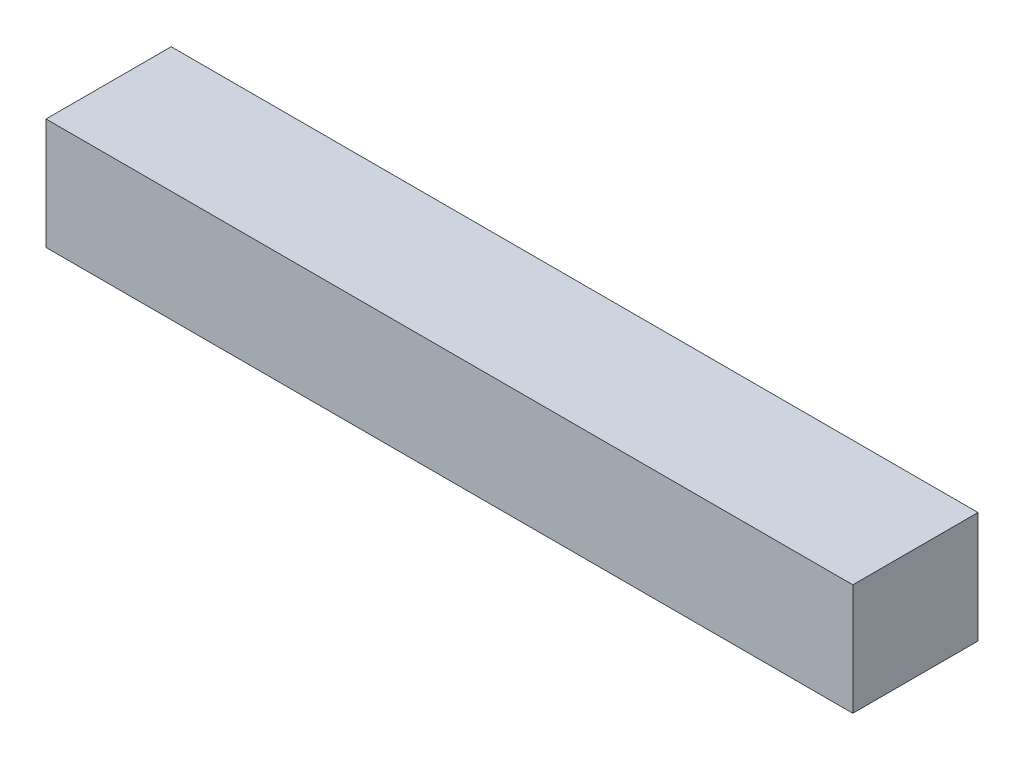
ISO-10303-21;
HEADER;
FILE_DESCRIPTION(('STEP AP214'),'2;1');
FILE_NAME('part.step','',(''),(''),'','','');
FILE_SCHEMA(('AUTOMOTIVE_DESIGN { 1 0 10303 214 1 1 1 1 }'));
ENDSEC;
DATA;
#1=APPLICATION_CONTEXT('core data for automotive mechanical design processes');
#2=APPLICATION_PROTOCOL_DEFINITION('international standard','automotive_design',2000,#1);
#3=PRODUCT_CONTEXT('',#1,'mechanical');
#4=PRODUCT('Part','Part','',(#3));
#5=PRODUCT_RELATED_PRODUCT_CATEGORY('part','',(#4));
#6=PRODUCT_DEFINITION_FORMATION('','',#4);
#7=PRODUCT_DEFINITION_CONTEXT('part definition',#1,'design');
#8=PRODUCT_DEFINITION('design','',#6,#7);
#9=PRODUCT_DEFINITION_SHAPE('','',#8);
#10=(LENGTH_UNIT() NAMED_UNIT(*) SI_UNIT(.MILLI.,.METRE.));
#11=(NAMED_UNIT(*) PLANE_ANGLE_UNIT() SI_UNIT($,.RADIAN.));
#12=(NAMED_UNIT(*) SI_UNIT($,.STERADIAN.) SOLID_ANGLE_UNIT());
#13=UNCERTAINTY_MEASURE_WITH_UNIT(LENGTH_MEASURE(1.E-05),#10,'distance_accuracy_value','');
#14=(GEOMETRIC_REPRESENTATION_CONTEXT(3) GLOBAL_UNCERTAINTY_ASSIGNED_CONTEXT((#13)) GLOBAL_UNIT_ASSIGNED_CONTEXT((#10,
#11,#12)) REPRESENTATION_CONTEXT('',''));
#15=CARTESIAN_POINT('',(0.,0.,0.));
#16=DIRECTION('',(0.,0.,1.));
#17=DIRECTION('',(1.,0.,0.));
#18=AXIS2_PLACEMENT_3D('',#15,#16,#17);
#19=CARTESIAN_POINT('',(29.,8.,-4.49999999999999));
#20=DIRECTION('',(-1.,0.,0.));
#21=DIRECTION('',(0.,0.,1.));
#22=AXIS2_PLACEMENT_3D('',#19,#20,#21);
#23=PLANE('',#22);
#24=DIRECTION('',(0.,0.,-1.));
#25=VECTOR('',#24,1.);
#26=CARTESIAN_POINT('',(29.,0.,-4.49999999999999));
#27=LINE('',#26,#25);
#28=CARTESIAN_POINT('',(29.,0.,4.50000000000002));
#29=VERTEX_POINT('',#28);
#30=CARTESIAN_POINT('',(29.,0.,-4.49999999999999));
#31=VERTEX_POINT('',#30);
#32=EDGE_CURVE('E97',#29,#31,#27,.T.);
#33=ORIENTED_EDGE('',*,*,#32,.T.);
#34=DIRECTION('',(0.,-1.,0.));
#35=VECTOR('',#34,1.);
#36=CARTESIAN_POINT('',(29.,8.,-4.49999999999999));
#37=LINE('',#36,#35);
#38=CARTESIAN_POINT('',(29.,8.,-4.49999999999999));
#39=VERTEX_POINT('',#38);
#40=EDGE_CURVE('E11',#39,#31,#37,.T.);
#41=ORIENTED_EDGE('',*,*,#40,.F.);
#42=DIRECTION('',(0.,0.,-1.));
#43=VECTOR('',#42,1.);
#44=CARTESIAN_POINT('',(29.,8.,-4.49999999999999));
#45=LINE('',#44,#43);
#46=CARTESIAN_POINT('',(29.,8.,4.50000000000002));
#47=VERTEX_POINT('',#46);
#48=EDGE_CURVE('E85',#47,#39,#45,.T.);
#49=ORIENTED_EDGE('',*,*,#48,.F.);
#50=DIRECTION('',(0.,-1.,0.));
#51=VECTOR('',#50,1.);
#52=CARTESIAN_POINT('',(29.,8.,4.50000000000002));
#53=LINE('',#52,#51);
#54=EDGE_CURVE('E93',#47,#29,#53,.T.);
#55=ORIENTED_EDGE('',*,*,#54,.T.);
#56=EDGE_LOOP('',(#33,#41,#49,#55));
#57=FACE_BOUND('',#56,.T.);
#58=ADVANCED_FACE('F34',(#57),#23,.F.);
#59=CARTESIAN_POINT('',(-29.,8.,-4.49999999999999));
#60=DIRECTION('',(0.,0.,1.));
#61=DIRECTION('',(1.,0.,0.));
#62=AXIS2_PLACEMENT_3D('',#59,#60,#61);
#63=PLANE('',#62);
#64=DIRECTION('',(-1.,0.,0.));
#65=VECTOR('',#64,1.);
#66=CARTESIAN_POINT('',(-29.,0.,-4.49999999999999));
#67=LINE('',#66,#65);
#68=CARTESIAN_POINT('',(-29.,0.,-4.49999999999999));
#69=VERTEX_POINT('',#68);
#70=EDGE_CURVE('E89',#31,#69,#67,.T.);
#71=ORIENTED_EDGE('',*,*,#70,.T.);
#72=DIRECTION('',(0.,-1.,0.));
#73=VECTOR('',#72,1.);
#74=CARTESIAN_POINT('',(-29.,8.,-4.49999999999999));
#75=LINE('',#74,#73);
#76=CARTESIAN_POINT('',(-29.,8.,-4.49999999999999));
#77=VERTEX_POINT('',#76);
#78=EDGE_CURVE('E42',#77,#69,#75,.T.);
#79=ORIENTED_EDGE('',*,*,#78,.F.);
#80=DIRECTION('',(-1.,0.,0.));
#81=VECTOR('',#80,1.);
#82=CARTESIAN_POINT('',(-29.,8.,-4.49999999999999));
#83=LINE('',#82,#81);
#84=EDGE_CURVE('E80',#39,#77,#83,.T.);
#85=ORIENTED_EDGE('',*,*,#84,.F.);
#86=ORIENTED_EDGE('',*,*,#40,.T.);
#87=EDGE_LOOP('',(#71,#79,#85,#86));
#88=FACE_BOUND('',#87,.T.);
#89=ADVANCED_FACE('F88',(#88),#63,.F.);
#90=CARTESIAN_POINT('',(-29.,8.,-4.49999999999999));
#91=DIRECTION('',(1.,0.,0.));
#92=DIRECTION('',(0.,0.,-1.));
#93=AXIS2_PLACEMENT_3D('',#90,#91,#92);
#94=PLANE('',#93);
#95=DIRECTION('',(0.,0.,1.));
#96=VECTOR('',#95,1.);
#97=CARTESIAN_POINT('',(-29.,0.,-4.49999999999999));
#98=LINE('',#97,#96);
#99=CARTESIAN_POINT('',(-29.,0.,4.50000000000002));
#100=VERTEX_POINT('',#99);
#101=EDGE_CURVE('E67',#69,#100,#98,.T.);
#102=ORIENTED_EDGE('',*,*,#101,.T.);
#103=DIRECTION('',(0.,-1.,0.));
#104=VECTOR('',#103,1.);
#105=CARTESIAN_POINT('',(-29.,8.,4.50000000000002));
#106=LINE('',#105,#104);
#107=CARTESIAN_POINT('',(-29.,8.,4.50000000000002));
#108=VERTEX_POINT('',#107);
#109=EDGE_CURVE('E90',#108,#100,#106,.T.);
#110=ORIENTED_EDGE('',*,*,#109,.F.);
#111=DIRECTION('',(0.,0.,1.));
#112=VECTOR('',#111,1.);
#113=CARTESIAN_POINT('',(-29.,8.,-4.49999999999999));
#114=LINE('',#113,#112);
#115=EDGE_CURVE('E83',#77,#108,#114,.T.);
#116=ORIENTED_EDGE('',*,*,#115,.F.);
#117=ORIENTED_EDGE('',*,*,#78,.T.);
#118=EDGE_LOOP('',(#102,#110,#116,#117));
#119=FACE_BOUND('',#118,.T.);
#120=ADVANCED_FACE('F91',(#119),#94,.F.);
#121=CARTESIAN_POINT('',(-29.,8.,4.50000000000002));
#122=DIRECTION('',(0.,0.,-1.));
#123=DIRECTION('',(-1.,0.,0.));
#124=AXIS2_PLACEMENT_3D('',#121,#122,#123);
#125=PLANE('',#124);
#126=DIRECTION('',(1.,0.,0.));
#127=VECTOR('',#126,1.);
#128=CARTESIAN_POINT('',(-29.,0.,4.50000000000002));
#129=LINE('',#128,#127);
#130=EDGE_CURVE('E73',#100,#29,#129,.T.);
#131=ORIENTED_EDGE('',*,*,#130,.T.);
#132=ORIENTED_EDGE('',*,*,#54,.F.);
#133=DIRECTION('',(1.,0.,0.));
#134=VECTOR('',#133,1.);
#135=CARTESIAN_POINT('',(-29.,8.,4.50000000000002));
#136=LINE('',#135,#134);
#137=EDGE_CURVE('E50',#108,#47,#136,.T.);
#138=ORIENTED_EDGE('',*,*,#137,.F.);
#139=ORIENTED_EDGE('',*,*,#109,.T.);
#140=EDGE_LOOP('',(#131,#132,#138,#139));
#141=FACE_BOUND('',#140,.T.);
#142=ADVANCED_FACE('F104',(#141),#125,.F.);
#143=CARTESIAN_POINT('',(0.,8.,0.));
#144=DIRECTION('',(0.,1.,0.));
#145=DIRECTION('',(0.,0.,1.));
#146=AXIS2_PLACEMENT_3D('',#143,#144,#145);
#147=PLANE('',#146);
#148=ORIENTED_EDGE('',*,*,#48,.T.);
#149=ORIENTED_EDGE('',*,*,#84,.T.);
#150=ORIENTED_EDGE('',*,*,#115,.T.);
#151=ORIENTED_EDGE('',*,*,#137,.T.);
#152=EDGE_LOOP('',(#148,#149,#150,#151));
#153=FACE_BOUND('',#152,.T.);
#154=ADVANCED_FACE('F81',(#153),#147,.T.);
#155=CARTESIAN_POINT('',(0.,0.,0.));
#156=DIRECTION('',(0.,1.,0.));
#157=DIRECTION('',(0.,0.,1.));
#158=AXIS2_PLACEMENT_3D('',#155,#156,#157);
#159=PLANE('',#158);
#160=ORIENTED_EDGE('',*,*,#32,.F.);
#161=ORIENTED_EDGE('',*,*,#130,.F.);
#162=ORIENTED_EDGE('',*,*,#101,.F.);
#163=ORIENTED_EDGE('',*,*,#70,.F.);
#164=EDGE_LOOP('',(#160,#161,#162,#163));
#165=FACE_BOUND('',#164,.T.);
#166=ADVANCED_FACE('F107',(#165),#159,.F.);
#167=CLOSED_SHELL('',(#58,#89,#120,#142,#154,#166));
#168=MANIFOLD_SOLID_BREP('B2',#167);
#169=ADVANCED_BREP_SHAPE_REPRESENTATION('',(#18,#168),#14);
#170=SHAPE_DEFINITION_REPRESENTATION(#9,#169);
ENDSEC;
END-ISO-10303-21;
